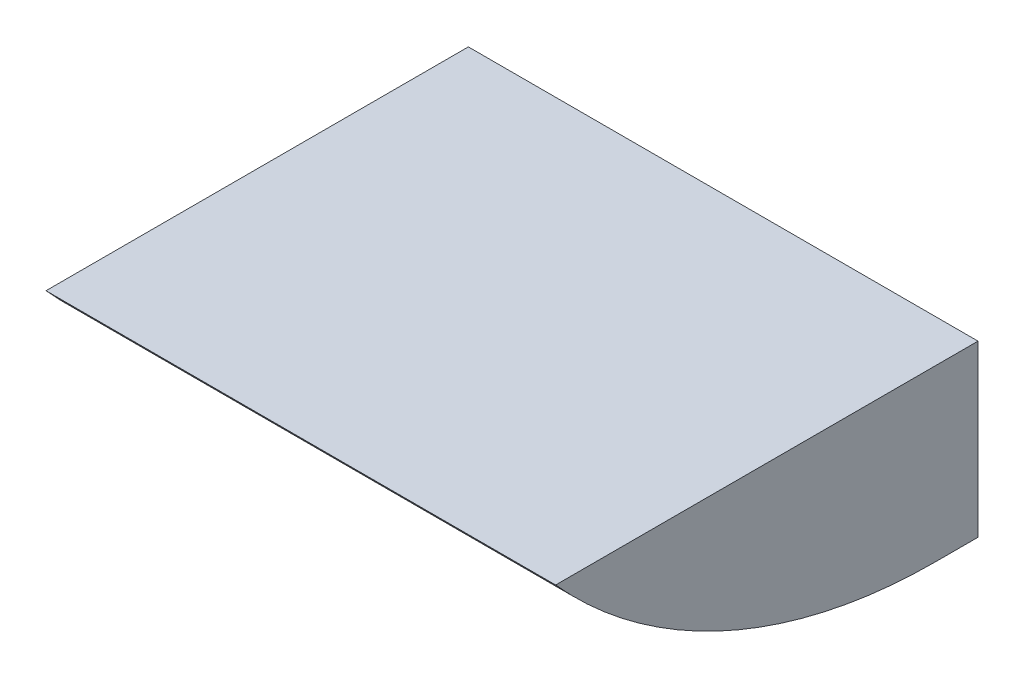
ISO-10303-21;
HEADER;
FILE_DESCRIPTION(('STEP AP214'),'2;1');
FILE_NAME('part.step','',(''),(''),'','','');
FILE_SCHEMA(('AUTOMOTIVE_DESIGN { 1 0 10303 214 1 1 1 1 }'));
ENDSEC;
DATA;
#1=APPLICATION_CONTEXT('core data for automotive mechanical design processes');
#2=APPLICATION_PROTOCOL_DEFINITION('international standard','automotive_design',2000,#1);
#3=PRODUCT_CONTEXT('',#1,'mechanical');
#4=PRODUCT('Part','Part','',(#3));
#5=PRODUCT_RELATED_PRODUCT_CATEGORY('part','',(#4));
#6=PRODUCT_DEFINITION_FORMATION('','',#4);
#7=PRODUCT_DEFINITION_CONTEXT('part definition',#1,'design');
#8=PRODUCT_DEFINITION('design','',#6,#7);
#9=PRODUCT_DEFINITION_SHAPE('','',#8);
#10=(LENGTH_UNIT() NAMED_UNIT(*) SI_UNIT(.MILLI.,.METRE.));
#11=(NAMED_UNIT(*) PLANE_ANGLE_UNIT() SI_UNIT($,.RADIAN.));
#12=(NAMED_UNIT(*) SI_UNIT($,.STERADIAN.) SOLID_ANGLE_UNIT());
#13=UNCERTAINTY_MEASURE_WITH_UNIT(LENGTH_MEASURE(1.E-05),#10,'distance_accuracy_value','');
#14=(GEOMETRIC_REPRESENTATION_CONTEXT(3) GLOBAL_UNCERTAINTY_ASSIGNED_CONTEXT((#13)) GLOBAL_UNIT_ASSIGNED_CONTEXT((#10,
#11,#12)) REPRESENTATION_CONTEXT('',''));
#15=CARTESIAN_POINT('',(0.,0.,0.));
#16=DIRECTION('',(0.,0.,1.));
#17=DIRECTION('',(1.,0.,0.));
#18=AXIS2_PLACEMENT_3D('',#15,#16,#17);
#19=CARTESIAN_POINT('',(1.75,0.75,0.200000000000001));
#20=DIRECTION('',(0.,0.,1.));
#21=DIRECTION('',(1.,0.,0.));
#22=AXIS2_PLACEMENT_3D('',#19,#20,#21);
#23=PLANE('',#22);
#24=DIRECTION('',(0.,-1.,0.));
#25=VECTOR('',#24,1.);
#26=CARTESIAN_POINT('',(2.86165567696216,-0.2,0.200000000000001));
#27=LINE('',#26,#25);
#28=CARTESIAN_POINT('',(2.86165567696216,-1.19209293965363E-07,0.200000000000001));
#29=VERTEX_POINT('',#28);
#30=CARTESIAN_POINT('',(2.86165567696216,-0.2,0.200000000000001));
#31=VERTEX_POINT('',#30);
#32=EDGE_CURVE('E76',#29,#31,#27,.T.);
#33=ORIENTED_EDGE('',*,*,#32,.T.);
#34=DIRECTION('',(1.,0.,0.));
#35=VECTOR('',#34,1.);
#36=CARTESIAN_POINT('',(0.,-0.199999999999999,0.200000000000001));
#37=LINE('',#36,#35);
#38=CARTESIAN_POINT('',(2.26165567696216,-0.199999999999999,0.200000000000001));
#39=VERTEX_POINT('',#38);
#40=EDGE_CURVE('E59',#39,#31,#37,.T.);
#41=ORIENTED_EDGE('',*,*,#40,.F.);
#42=DIRECTION('',(0.,1.,0.));
#43=VECTOR('',#42,1.);
#44=CARTESIAN_POINT('',(2.26165567696216,-0.2,0.200000000000001));
#45=LINE('',#44,#43);
#46=CARTESIAN_POINT('',(2.26165567696216,-1.19209293965363E-07,0.200000000000001));
#47=VERTEX_POINT('',#46);
#48=EDGE_CURVE('E60',#39,#47,#45,.T.);
#49=ORIENTED_EDGE('',*,*,#48,.T.);
#50=DIRECTION('',(1.,0.,0.));
#51=VECTOR('',#50,1.);
#52=CARTESIAN_POINT('',(3.24180504999582,-1.19209293963918E-07,0.200000000000001));
#53=LINE('',#52,#51);
#54=EDGE_CURVE('E56',#47,#29,#53,.T.);
#55=ORIENTED_EDGE('',*,*,#54,.T.);
#56=EDGE_LOOP('',(#33,#41,#49,#55));
#57=FACE_BOUND('',#56,.T.);
#58=ADVANCED_FACE('F17',(#57),#23,.F.);
#59=CARTESIAN_POINT('',(3.24180504999582,-1.19209293963918E-07,-1.04509067385267));
#60=DIRECTION('',(0.,-1.,0.));
#61=DIRECTION('',(0.,0.,-1.));
#62=AXIS2_PLACEMENT_3D('',#59,#60,#61);
#63=PLANE('',#62);
#64=DIRECTION('',(1.,0.,0.));
#65=VECTOR('',#64,1.);
#66=CARTESIAN_POINT('',(0.,-1.19209293532405E-07,0.697213488875896));
#67=LINE('',#66,#65);
#68=CARTESIAN_POINT('',(2.86165567696216,-1.19209294020296E-07,0.697213488875897));
#69=VERTEX_POINT('',#68);
#70=CARTESIAN_POINT('',(2.26165567696216,-1.19209293959836E-07,0.697213488875896));
#71=VERTEX_POINT('',#70);
#72=EDGE_CURVE('E53',#69,#71,#67,.F.);
#73=ORIENTED_EDGE('',*,*,#72,.F.);
#74=DIRECTION('',(0.,0.,1.));
#75=VECTOR('',#74,1.);
#76=CARTESIAN_POINT('',(2.86165567696216,-1.19209293966086E-07,0.250000000000001));
#77=LINE('',#76,#75);
#78=EDGE_CURVE('E69',#69,#29,#77,.F.);
#79=ORIENTED_EDGE('',*,*,#78,.T.);
#80=ORIENTED_EDGE('',*,*,#54,.F.);
#81=DIRECTION('',(0.,0.,1.));
#82=VECTOR('',#81,1.);
#83=CARTESIAN_POINT('',(2.26165567696216,-1.19209293966086E-07,0.850000000000001));
#84=LINE('',#83,#82);
#85=EDGE_CURVE('E48',#47,#71,#84,.T.);
#86=ORIENTED_EDGE('',*,*,#85,.T.);
#87=EDGE_LOOP('',(#73,#79,#80,#86));
#88=FACE_BOUND('',#87,.T.);
#89=ADVANCED_FACE('F50',(#88),#63,.F.);
#90=CARTESIAN_POINT('',(2.26165567696216,-0.2,0.850000000000001));
#91=DIRECTION('',(1.,0.,0.));
#92=DIRECTION('',(0.,1.,0.));
#93=AXIS2_PLACEMENT_3D('',#90,#91,#92);
#94=PLANE('',#93);
#95=ORIENTED_EDGE('',*,*,#48,.F.);
#96=DIRECTION('',(0.,0.,1.));
#97=VECTOR('',#96,1.);
#98=CARTESIAN_POINT('',(2.26165567696216,-0.199999999999999,0.));
#99=LINE('',#98,#97);
#100=CARTESIAN_POINT('',(2.26165567696216,-0.199999999999999,0.250000000000001));
#101=VERTEX_POINT('',#100);
#102=EDGE_CURVE('E65',#101,#39,#99,.F.);
#103=ORIENTED_EDGE('',*,*,#102,.F.);
#104=CARTESIAN_POINT('',(2.26165567696216,0.400000000000001,0.250000000000001));
#105=DIRECTION('',(1.,0.,0.));
#106=DIRECTION('',(0.,0.,-1.));
#107=AXIS2_PLACEMENT_3D('',#104,#105,#106);
#108=CIRCLE('',#107,0.6);
#109=EDGE_CURVE('E20',#71,#101,#108,.T.);
#110=ORIENTED_EDGE('',*,*,#109,.F.);
#111=ORIENTED_EDGE('',*,*,#85,.F.);
#112=EDGE_LOOP('',(#95,#103,#110,#111));
#113=FACE_BOUND('',#112,.T.);
#114=ADVANCED_FACE('F63',(#113),#94,.F.);
#115=CARTESIAN_POINT('',(0.,-0.199999999999999,0.));
#116=DIRECTION('',(0.,-1.,0.));
#117=DIRECTION('',(1.,0.,0.));
#118=AXIS2_PLACEMENT_3D('',#115,#116,#117);
#119=PLANE('',#118);
#120=DIRECTION('',(1.,0.,0.));
#121=VECTOR('',#120,1.);
#122=CARTESIAN_POINT('',(0.,-0.199999999999999,0.250000000000001));
#123=LINE('',#122,#121);
#124=CARTESIAN_POINT('',(2.86165567696216,-0.2,0.250000000000001));
#125=VERTEX_POINT('',#124);
#126=EDGE_CURVE('E26',#101,#125,#123,.T.);
#127=ORIENTED_EDGE('',*,*,#126,.F.);
#128=ORIENTED_EDGE('',*,*,#102,.T.);
#129=ORIENTED_EDGE('',*,*,#40,.T.);
#130=DIRECTION('',(0.,0.,1.));
#131=VECTOR('',#130,1.);
#132=CARTESIAN_POINT('',(2.86165567696216,-0.2,0.250000000000001));
#133=LINE('',#132,#131);
#134=EDGE_CURVE('E33',#31,#125,#133,.T.);
#135=ORIENTED_EDGE('',*,*,#134,.T.);
#136=EDGE_LOOP('',(#127,#128,#129,#135));
#137=FACE_BOUND('',#136,.T.);
#138=ADVANCED_FACE('F99',(#137),#119,.T.);
#139=CARTESIAN_POINT('',(2.86165567696216,-0.2,0.250000000000001));
#140=DIRECTION('',(-1.,0.,0.));
#141=DIRECTION('',(0.,-1.,0.));
#142=AXIS2_PLACEMENT_3D('',#139,#140,#141);
#143=PLANE('',#142);
#144=CARTESIAN_POINT('',(2.86165567696216,0.400000000000001,0.250000000000001));
#145=DIRECTION('',(1.,0.,0.));
#146=DIRECTION('',(0.,0.,-1.));
#147=AXIS2_PLACEMENT_3D('',#144,#145,#146);
#148=CIRCLE('',#147,0.6);
#149=EDGE_CURVE('E11',#125,#69,#148,.F.);
#150=ORIENTED_EDGE('',*,*,#149,.F.);
#151=ORIENTED_EDGE('',*,*,#134,.F.);
#152=ORIENTED_EDGE('',*,*,#32,.F.);
#153=ORIENTED_EDGE('',*,*,#78,.F.);
#154=EDGE_LOOP('',(#150,#151,#152,#153));
#155=FACE_BOUND('',#154,.T.);
#156=ADVANCED_FACE('F103',(#155),#143,.F.);
#157=CARTESIAN_POINT('',(0.,0.400000000000001,0.250000000000001));
#158=DIRECTION('',(1.,0.,0.));
#159=DIRECTION('',(0.,0.,-1.));
#160=AXIS2_PLACEMENT_3D('',#157,#158,#159);
#161=CYLINDRICAL_SURFACE('',#160,0.6);
#162=ORIENTED_EDGE('',*,*,#126,.T.);
#163=ORIENTED_EDGE('',*,*,#149,.T.);
#164=ORIENTED_EDGE('',*,*,#72,.T.);
#165=ORIENTED_EDGE('',*,*,#109,.T.);
#166=EDGE_LOOP('',(#162,#163,#164,#165));
#167=FACE_BOUND('',#166,.T.);
#168=ADVANCED_FACE('F68',(#167),#161,.T.);
#169=CLOSED_SHELL('',(#58,#89,#114,#138,#156,#168));
#170=MANIFOLD_SOLID_BREP('B1',#169);
#171=ADVANCED_BREP_SHAPE_REPRESENTATION('',(#18,#170),#14);
#172=SHAPE_DEFINITION_REPRESENTATION(#9,#171);
ENDSEC;
END-ISO-10303-21;
